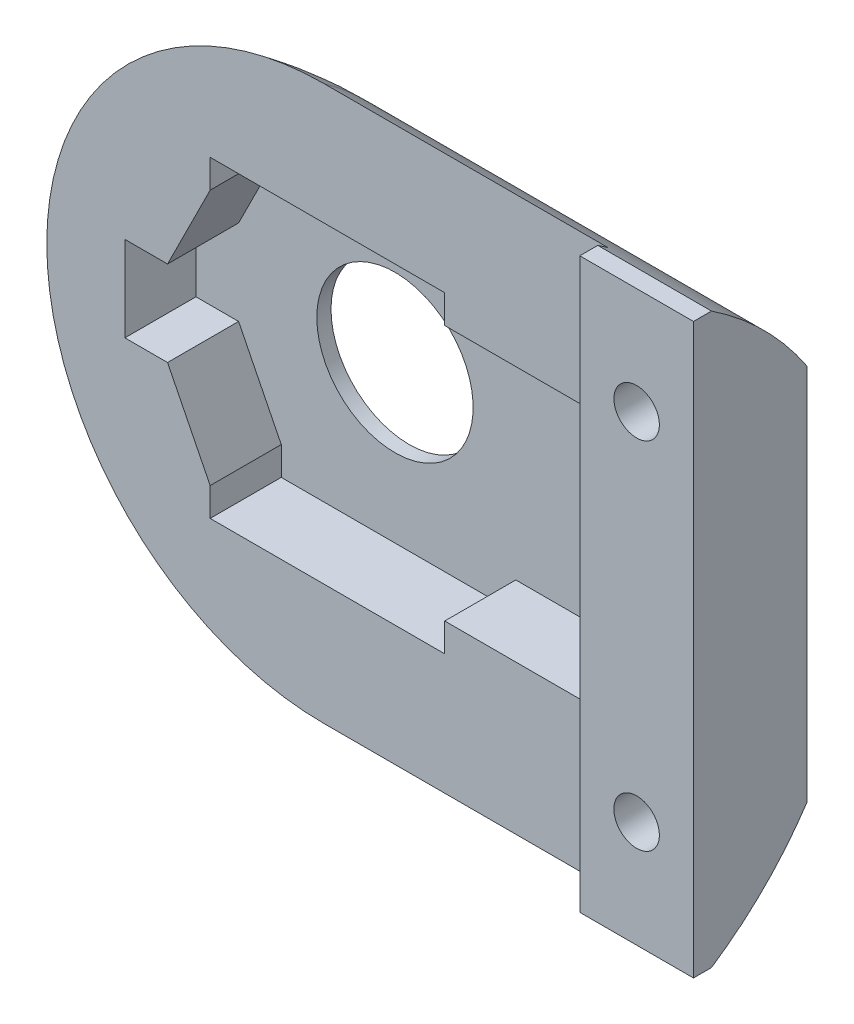
ISO-10303-21;
HEADER;
FILE_DESCRIPTION(('STEP AP214'),'2;1');
FILE_NAME('part.step','',(''),(''),'','','');
FILE_SCHEMA(('AUTOMOTIVE_DESIGN { 1 0 10303 214 1 1 1 1 }'));
ENDSEC;
DATA;
#1=APPLICATION_CONTEXT('core data for automotive mechanical design processes');
#2=APPLICATION_PROTOCOL_DEFINITION('international standard','automotive_design',2000,#1);
#3=PRODUCT_CONTEXT('',#1,'mechanical');
#4=PRODUCT('Part','Part','',(#3));
#5=PRODUCT_RELATED_PRODUCT_CATEGORY('part','',(#4));
#6=PRODUCT_DEFINITION_FORMATION('','',#4);
#7=PRODUCT_DEFINITION_CONTEXT('part definition',#1,'design');
#8=PRODUCT_DEFINITION('design','',#6,#7);
#9=PRODUCT_DEFINITION_SHAPE('','',#8);
#10=(LENGTH_UNIT() NAMED_UNIT(*) SI_UNIT(.MILLI.,.METRE.));
#11=(NAMED_UNIT(*) PLANE_ANGLE_UNIT() SI_UNIT($,.RADIAN.));
#12=(NAMED_UNIT(*) SI_UNIT($,.STERADIAN.) SOLID_ANGLE_UNIT());
#13=UNCERTAINTY_MEASURE_WITH_UNIT(LENGTH_MEASURE(1.E-05),#10,'distance_accuracy_value','');
#14=(GEOMETRIC_REPRESENTATION_CONTEXT(3) GLOBAL_UNCERTAINTY_ASSIGNED_CONTEXT((#13)) GLOBAL_UNIT_ASSIGNED_CONTEXT((#10,
#11,#12)) REPRESENTATION_CONTEXT('',''));
#15=CARTESIAN_POINT('',(0.,0.,0.));
#16=DIRECTION('',(0.,0.,1.));
#17=DIRECTION('',(1.,0.,0.));
#18=AXIS2_PLACEMENT_3D('',#15,#16,#17);
#19=CARTESIAN_POINT('',(0.,0.,0.));
#20=DIRECTION('',(0.,0.,1.));
#21=DIRECTION('',(1.,0.,0.));
#22=AXIS2_PLACEMENT_3D('',#19,#20,#21);
#23=PLANE('',#22);
#24=CARTESIAN_POINT('',(-6.94201640616399E-10,0.,0.));
#25=DIRECTION('',(0.,0.,1.));
#26=DIRECTION('',(1.,0.,0.));
#27=AXIS2_PLACEMENT_3D('',#24,#25,#26);
#28=CIRCLE('',#27,2.75);
#29=CARTESIAN_POINT('',(2.7499999993058,0.,0.));
#30=VERTEX_POINT('',#29);
#31=EDGE_CURVE('E241',#30,#30,#28,.T.);
#32=ORIENTED_EDGE('',*,*,#31,.T.);
#33=EDGE_LOOP('',(#32));
#34=FACE_BOUND('',#33,.T.);
#35=DIRECTION('',(-1.,0.,0.));
#36=VECTOR('',#35,1.);
#37=CARTESIAN_POINT('',(13.9999999993058,-6.6332495807108,0.));
#38=LINE('',#37,#36);
#39=CARTESIAN_POINT('',(0.,-6.6332495807108,0.));
#40=VERTEX_POINT('',#39);
#41=CARTESIAN_POINT('',(10.8102017983973,-6.6332495807108,0.));
#42=VERTEX_POINT('',#41);
#43=EDGE_CURVE('E219',#40,#42,#38,.F.);
#44=ORIENTED_EDGE('',*,*,#43,.F.);
#45=CARTESIAN_POINT('',(0.,0.,0.));
#46=DIRECTION('',(0.,0.,1.));
#47=DIRECTION('',(1.,0.,0.));
#48=AXIS2_PLACEMENT_3D('',#45,#46,#47);
#49=CIRCLE('',#48,6.6332495807108);
#50=CARTESIAN_POINT('',(0.,6.6332495807108,0.));
#51=VERTEX_POINT('',#50);
#52=EDGE_CURVE('E226',#51,#40,#49,.T.);
#53=ORIENTED_EDGE('',*,*,#52,.F.);
#54=DIRECTION('',(-1.,0.,0.));
#55=VECTOR('',#54,1.);
#56=CARTESIAN_POINT('',(13.9999999993058,6.6332495807108,0.));
#57=LINE('',#56,#55);
#58=CARTESIAN_POINT('',(11.297775135829,6.6332495807108,0.));
#59=VERTEX_POINT('',#58);
#60=EDGE_CURVE('E468',#59,#51,#57,.T.);
#61=ORIENTED_EDGE('',*,*,#60,.F.);
#62=CARTESIAN_POINT('',(11.9999999993058,6.25,0.));
#63=DIRECTION('',(0.,0.,1.));
#64=DIRECTION('',(1.,0.,0.));
#65=AXIS2_PLACEMENT_3D('',#62,#63,#64);
#66=CIRCLE('',#65,0.799999999999995);
#67=CARTESIAN_POINT('',(12.7022248627826,6.6332495807108,0.));
#68=VERTEX_POINT('',#67);
#69=EDGE_CURVE('E356',#59,#68,#66,.T.);
#70=ORIENTED_EDGE('',*,*,#69,.T.);
#71=CARTESIAN_POINT('',(13.9999999993058,6.6332495807108,0.));
#72=VERTEX_POINT('',#71);
#73=EDGE_CURVE('E554',#72,#68,#57,.T.);
#74=ORIENTED_EDGE('',*,*,#73,.F.);
#75=DIRECTION('',(0.,-1.,0.));
#76=VECTOR('',#75,1.);
#77=CARTESIAN_POINT('',(13.9999999993058,0.,0.));
#78=LINE('',#77,#76);
#79=CARTESIAN_POINT('',(13.9999999993058,-6.6332495807108,0.));
#80=VERTEX_POINT('',#79);
#81=EDGE_CURVE('E367',#72,#80,#78,.T.);
#82=ORIENTED_EDGE('',*,*,#81,.T.);
#83=CARTESIAN_POINT('',(13.1897982002143,-6.6332495807108,0.));
#84=VERTEX_POINT('',#83);
#85=EDGE_CURVE('E237',#84,#80,#38,.F.);
#86=ORIENTED_EDGE('',*,*,#85,.F.);
#87=CARTESIAN_POINT('',(11.9999999993058,-6.25,0.));
#88=DIRECTION('',(0.,0.,1.));
#89=DIRECTION('',(1.,0.,0.));
#90=AXIS2_PLACEMENT_3D('',#87,#88,#89);
#91=CIRCLE('',#90,1.25);
#92=EDGE_CURVE('E235',#84,#42,#91,.T.);
#93=ORIENTED_EDGE('',*,*,#92,.T.);
#94=EDGE_LOOP('',(#44,#53,#61,#70,#74,#82,#86,#93));
#95=FACE_BOUND('',#94,.T.);
#96=ADVANCED_FACE('F53',(#34,#95),#23,.F.);
#97=CARTESIAN_POINT('',(0.,0.,3.));
#98=DIRECTION('',(0.,0.,1.));
#99=DIRECTION('',(1.,0.,0.));
#100=AXIS2_PLACEMENT_3D('',#97,#98,#99);
#101=PLANE('',#100);
#102=DIRECTION('',(1.,0.,0.));
#103=VECTOR('',#102,1.);
#104=CARTESIAN_POINT('',(-6.9999999985747,-1.5000000000001,3.));
#105=LINE('',#104,#103);
#106=CARTESIAN_POINT('',(-6.9999999985747,-1.5000000000001,3.));
#107=VERTEX_POINT('',#106);
#108=CARTESIAN_POINT('',(-5.49999999857466,-1.50000000000009,3.));
#109=VERTEX_POINT('',#108);
#110=EDGE_CURVE('E250',#107,#109,#105,.T.);
#111=ORIENTED_EDGE('',*,*,#110,.F.);
#112=DIRECTION('',(0.,-1.,0.));
#113=VECTOR('',#112,1.);
#114=CARTESIAN_POINT('',(-6.9999999985747,0.,3.));
#115=LINE('',#114,#113);
#116=CARTESIAN_POINT('',(-6.9999999985747,1.49999999999992,3.));
#117=VERTEX_POINT('',#116);
#118=EDGE_CURVE('E248',#117,#107,#115,.T.);
#119=ORIENTED_EDGE('',*,*,#118,.F.);
#120=DIRECTION('',(-1.,0.,0.));
#121=VECTOR('',#120,1.);
#122=CARTESIAN_POINT('',(-6.9999999985747,1.49999999999992,3.));
#123=LINE('',#122,#121);
#124=CARTESIAN_POINT('',(-5.49999999857472,1.49999999999992,3.));
#125=VERTEX_POINT('',#124);
#126=EDGE_CURVE('E275',#125,#117,#123,.T.);
#127=ORIENTED_EDGE('',*,*,#126,.F.);
#128=DIRECTION('',(-0.447213595499941,-0.894427190999924,0.));
#129=VECTOR('',#128,1.);
#130=CARTESIAN_POINT('',(-5.49999999857472,1.49999999999992,3.));
#131=LINE('',#130,#129);
#132=CARTESIAN_POINT('',(-3.99999999857474,4.50000000000002,3.));
#133=VERTEX_POINT('',#132);
#134=EDGE_CURVE('E273',#133,#125,#131,.T.);
#135=ORIENTED_EDGE('',*,*,#134,.F.);
#136=DIRECTION('',(0.,-1.,0.));
#137=VECTOR('',#136,1.);
#138=CARTESIAN_POINT('',(-3.99999999857474,4.50000000000002,3.));
#139=LINE('',#138,#137);
#140=CARTESIAN_POINT('',(-3.99999999857474,5.5,3.));
#141=VERTEX_POINT('',#140);
#142=EDGE_CURVE('E271',#141,#133,#139,.T.);
#143=ORIENTED_EDGE('',*,*,#142,.F.);
#144=DIRECTION('',(-1.,0.,0.));
#145=VECTOR('',#144,1.);
#146=CARTESIAN_POINT('',(1.42531125790768E-09,5.5,3.));
#147=LINE('',#146,#145);
#148=CARTESIAN_POINT('',(4.25000000142571,5.5,3.));
#149=VERTEX_POINT('',#148);
#150=EDGE_CURVE('E269',#149,#141,#147,.T.);
#151=ORIENTED_EDGE('',*,*,#150,.F.);
#152=DIRECTION('',(0.,1.,0.));
#153=VECTOR('',#152,1.);
#154=CARTESIAN_POINT('',(4.25000000142571,5.5,3.));
#155=LINE('',#154,#153);
#156=CARTESIAN_POINT('',(4.25000000142571,4.49999999999989,3.));
#157=VERTEX_POINT('',#156);
#158=EDGE_CURVE('E267',#157,#149,#155,.T.);
#159=ORIENTED_EDGE('',*,*,#158,.F.);
#160=DIRECTION('',(-1.,0.,0.));
#161=VECTOR('',#160,1.);
#162=CARTESIAN_POINT('',(4.25000000142571,4.49999999999989,3.));
#163=LINE('',#162,#161);
#164=CARTESIAN_POINT('',(9.50000000142534,4.49999999999989,3.));
#165=VERTEX_POINT('',#164);
#166=EDGE_CURVE('E265',#165,#157,#163,.T.);
#167=ORIENTED_EDGE('',*,*,#166,.F.);
#168=DIRECTION('',(0.,1.,0.));
#169=VECTOR('',#168,1.);
#170=CARTESIAN_POINT('',(9.50000000142534,-4.49999999999996,3.));
#171=LINE('',#170,#169);
#172=CARTESIAN_POINT('',(9.50000000142534,-4.49999999999996,3.));
#173=VERTEX_POINT('',#172);
#174=EDGE_CURVE('E263',#173,#165,#171,.T.);
#175=ORIENTED_EDGE('',*,*,#174,.F.);
#176=DIRECTION('',(1.,0.,0.));
#177=VECTOR('',#176,1.);
#178=CARTESIAN_POINT('',(4.2500000014254,-4.49999999999996,3.));
#179=LINE('',#178,#177);
#180=CARTESIAN_POINT('',(4.2500000014254,-4.49999999999996,3.));
#181=VERTEX_POINT('',#180);
#182=EDGE_CURVE('E261',#181,#173,#179,.T.);
#183=ORIENTED_EDGE('',*,*,#182,.F.);
#184=DIRECTION('',(0.,1.,0.));
#185=VECTOR('',#184,1.);
#186=CARTESIAN_POINT('',(4.2500000014254,-5.50000000000002,3.));
#187=LINE('',#186,#185);
#188=CARTESIAN_POINT('',(4.2500000014254,-5.50000000000002,3.));
#189=VERTEX_POINT('',#188);
#190=EDGE_CURVE('E259',#189,#181,#187,.T.);
#191=ORIENTED_EDGE('',*,*,#190,.F.);
#192=DIRECTION('',(1.,0.,0.));
#193=VECTOR('',#192,1.);
#194=CARTESIAN_POINT('',(-3.99999999857464,-5.50000000000002,3.));
#195=LINE('',#194,#193);
#196=CARTESIAN_POINT('',(-3.99999999857464,-5.50000000000002,3.));
#197=VERTEX_POINT('',#196);
#198=EDGE_CURVE('E257',#197,#189,#195,.T.);
#199=ORIENTED_EDGE('',*,*,#198,.F.);
#200=DIRECTION('',(0.,-1.,0.));
#201=VECTOR('',#200,1.);
#202=CARTESIAN_POINT('',(-3.99999999857464,-4.50000000000002,3.));
#203=LINE('',#202,#201);
#204=CARTESIAN_POINT('',(-3.99999999857464,-4.50000000000002,3.));
#205=VERTEX_POINT('',#204);
#206=EDGE_CURVE('E255',#205,#197,#203,.T.);
#207=ORIENTED_EDGE('',*,*,#206,.F.);
#208=DIRECTION('',(0.447213595499971,-0.894427190999909,0.));
#209=VECTOR('',#208,1.);
#210=CARTESIAN_POINT('',(-5.49999999857466,-1.50000000000009,3.));
#211=LINE('',#210,#209);
#212=EDGE_CURVE('E253',#109,#205,#211,.T.);
#213=ORIENTED_EDGE('',*,*,#212,.F.);
#214=EDGE_LOOP('',(#111,#119,#127,#135,#143,#151,#159,#167,#175,#183,#191,#199,#207,#213));
#215=FACE_BOUND('',#214,.T.);
#216=CARTESIAN_POINT('',(0.,0.,3.));
#217=DIRECTION('',(0.,0.,1.));
#218=DIRECTION('',(1.,0.,0.));
#219=AXIS2_PLACEMENT_3D('',#216,#217,#218);
#220=CIRCLE('',#219,9.74679434480896);
#221=CARTESIAN_POINT('',(0.,9.74679434480896,3.));
#222=VERTEX_POINT('',#221);
#223=CARTESIAN_POINT('',(0.,-9.74679434480896,3.));
#224=VERTEX_POINT('',#223);
#225=EDGE_CURVE('E12',#222,#224,#220,.T.);
#226=ORIENTED_EDGE('',*,*,#225,.T.);
#227=DIRECTION('',(-1.,0.,0.));
#228=VECTOR('',#227,1.);
#229=CARTESIAN_POINT('',(13.9999999993058,-9.74679434480896,3.));
#230=LINE('',#229,#228);
#231=CARTESIAN_POINT('',(9.9999999993058,-9.74679434480896,3.));
#232=VERTEX_POINT('',#231);
#233=EDGE_CURVE('E222',#224,#232,#230,.F.);
#234=ORIENTED_EDGE('',*,*,#233,.T.);
#235=DIRECTION('',(0.,-1.,0.));
#236=VECTOR('',#235,1.);
#237=CARTESIAN_POINT('',(9.9999999993058,0.,3.));
#238=LINE('',#237,#236);
#239=CARTESIAN_POINT('',(9.9999999993058,9.74679434480896,3.));
#240=VERTEX_POINT('',#239);
#241=EDGE_CURVE('E360',#240,#232,#238,.T.);
#242=ORIENTED_EDGE('',*,*,#241,.F.);
#243=DIRECTION('',(-1.,0.,0.));
#244=VECTOR('',#243,1.);
#245=CARTESIAN_POINT('',(13.9999999993058,9.74679434480896,3.));
#246=LINE('',#245,#244);
#247=EDGE_CURVE('E455',#240,#222,#246,.T.);
#248=ORIENTED_EDGE('',*,*,#247,.T.);
#249=EDGE_LOOP('',(#226,#234,#242,#248));
#250=FACE_BOUND('',#249,.T.);
#251=ADVANCED_FACE('F410',(#215,#250),#101,.T.);
#252=CARTESIAN_POINT('',(13.9999999993058,0.,4.));
#253=DIRECTION('',(1.,0.,0.));
#254=DIRECTION('',(0.,0.,-1.));
#255=AXIS2_PLACEMENT_3D('',#252,#253,#254);
#256=PLANE('',#255);
#257=DIRECTION('',(0.,0.,-1.));
#258=VECTOR('',#257,1.);
#259=CARTESIAN_POINT('',(13.9999999993058,-10.,4.));
#260=LINE('',#259,#258);
#261=CARTESIAN_POINT('',(13.9999999993058,-10.,4.));
#262=VERTEX_POINT('',#261);
#263=CARTESIAN_POINT('',(13.9999999993058,-10.,3.3667504192892));
#264=VERTEX_POINT('',#263);
#265=EDGE_CURVE('E382',#262,#264,#260,.T.);
#266=ORIENTED_EDGE('',*,*,#265,.T.);
#267=CARTESIAN_POINT('',(13.9999999993058,0.,10.));
#268=DIRECTION('',(1.,0.,0.));
#269=DIRECTION('',(0.,0.,-1.));
#270=AXIS2_PLACEMENT_3D('',#267,#268,#269);
#271=CIRCLE('',#270,12.);
#272=EDGE_CURVE('E552',#80,#264,#271,.F.);
#273=ORIENTED_EDGE('',*,*,#272,.F.);
#274=ORIENTED_EDGE('',*,*,#81,.F.);
#275=CARTESIAN_POINT('',(13.9999999993058,0.,10.));
#276=DIRECTION('',(1.,0.,0.));
#277=DIRECTION('',(0.,0.,-1.));
#278=AXIS2_PLACEMENT_3D('',#275,#276,#277);
#279=CIRCLE('',#278,12.);
#280=CARTESIAN_POINT('',(13.9999999993058,10.,3.3667504192892));
#281=VERTEX_POINT('',#280);
#282=EDGE_CURVE('E444',#281,#72,#279,.F.);
#283=ORIENTED_EDGE('',*,*,#282,.F.);
#284=DIRECTION('',(0.,0.,-1.));
#285=VECTOR('',#284,1.);
#286=CARTESIAN_POINT('',(13.9999999993058,10.,4.));
#287=LINE('',#286,#285);
#288=CARTESIAN_POINT('',(13.9999999993058,10.,4.));
#289=VERTEX_POINT('',#288);
#290=EDGE_CURVE('E377',#289,#281,#287,.T.);
#291=ORIENTED_EDGE('',*,*,#290,.F.);
#292=DIRECTION('',(0.,-1.,0.));
#293=VECTOR('',#292,1.);
#294=CARTESIAN_POINT('',(13.9999999993058,0.,4.));
#295=LINE('',#294,#293);
#296=EDGE_CURVE('E374',#289,#262,#295,.T.);
#297=ORIENTED_EDGE('',*,*,#296,.T.);
#298=EDGE_LOOP('',(#266,#273,#274,#283,#291,#297));
#299=FACE_BOUND('',#298,.T.);
#300=ADVANCED_FACE('F416',(#299),#256,.T.);
#301=CARTESIAN_POINT('',(9.9999999993058,0.,3.));
#302=DIRECTION('',(-1.,0.,0.));
#303=DIRECTION('',(0.,0.,1.));
#304=AXIS2_PLACEMENT_3D('',#301,#302,#303);
#305=PLANE('',#304);
#306=ORIENTED_EDGE('',*,*,#241,.T.);
#307=CARTESIAN_POINT('',(9.9999999993058,0.,10.));
#308=DIRECTION('',(-1.,0.,0.));
#309=DIRECTION('',(0.,0.,1.));
#310=AXIS2_PLACEMENT_3D('',#307,#308,#309);
#311=CIRCLE('',#310,12.);
#312=CARTESIAN_POINT('',(9.9999999993058,-10.,3.3667504192892));
#313=VERTEX_POINT('',#312);
#314=EDGE_CURVE('E451',#232,#313,#311,.T.);
#315=ORIENTED_EDGE('',*,*,#314,.T.);
#316=DIRECTION('',(0.,0.,1.));
#317=VECTOR('',#316,1.);
#318=CARTESIAN_POINT('',(9.9999999993058,-10.,3.));
#319=LINE('',#318,#317);
#320=CARTESIAN_POINT('',(9.9999999993058,-10.,4.));
#321=VERTEX_POINT('',#320);
#322=EDGE_CURVE('E76',#313,#321,#319,.T.);
#323=ORIENTED_EDGE('',*,*,#322,.T.);
#324=DIRECTION('',(0.,-1.,0.));
#325=VECTOR('',#324,1.);
#326=CARTESIAN_POINT('',(9.9999999993058,0.,4.));
#327=LINE('',#326,#325);
#328=CARTESIAN_POINT('',(9.9999999993058,10.,4.));
#329=VERTEX_POINT('',#328);
#330=EDGE_CURVE('E61',#329,#321,#327,.T.);
#331=ORIENTED_EDGE('',*,*,#330,.F.);
#332=DIRECTION('',(0.,0.,1.));
#333=VECTOR('',#332,1.);
#334=CARTESIAN_POINT('',(9.9999999993058,10.,3.));
#335=LINE('',#334,#333);
#336=CARTESIAN_POINT('',(9.9999999993058,10.,3.3667504192892));
#337=VERTEX_POINT('',#336);
#338=EDGE_CURVE('E365',#337,#329,#335,.T.);
#339=ORIENTED_EDGE('',*,*,#338,.F.);
#340=CARTESIAN_POINT('',(9.9999999993058,0.,10.));
#341=DIRECTION('',(-1.,0.,0.));
#342=DIRECTION('',(0.,0.,1.));
#343=AXIS2_PLACEMENT_3D('',#340,#341,#342);
#344=CIRCLE('',#343,12.);
#345=EDGE_CURVE('E452',#337,#240,#344,.T.);
#346=ORIENTED_EDGE('',*,*,#345,.T.);
#347=EDGE_LOOP('',(#306,#315,#323,#331,#339,#346));
#348=FACE_BOUND('',#347,.T.);
#349=ADVANCED_FACE('F422',(#348),#305,.T.);
#350=CARTESIAN_POINT('',(0.,-10.,4.));
#351=DIRECTION('',(0.,-1.,0.));
#352=DIRECTION('',(1.,0.,0.));
#353=AXIS2_PLACEMENT_3D('',#350,#351,#352);
#354=PLANE('',#353);
#355=ORIENTED_EDGE('',*,*,#322,.F.);
#356=DIRECTION('',(-1.,0.,0.));
#357=VECTOR('',#356,1.);
#358=CARTESIAN_POINT('',(13.9999999993058,-10.,3.3667504192892));
#359=LINE('',#358,#357);
#360=EDGE_CURVE('E236',#313,#264,#359,.F.);
#361=ORIENTED_EDGE('',*,*,#360,.T.);
#362=ORIENTED_EDGE('',*,*,#265,.F.);
#363=DIRECTION('',(-1.,0.,0.));
#364=VECTOR('',#363,1.);
#365=CARTESIAN_POINT('',(0.,-10.,4.));
#366=LINE('',#365,#364);
#367=EDGE_CURVE('E371',#262,#321,#366,.T.);
#368=ORIENTED_EDGE('',*,*,#367,.T.);
#369=EDGE_LOOP('',(#355,#361,#362,#368));
#370=FACE_BOUND('',#369,.T.);
#371=ADVANCED_FACE('F424',(#370),#354,.T.);
#372=CARTESIAN_POINT('',(11.9999999993058,-6.25,2.));
#373=DIRECTION('',(0.,0.,-1.));
#374=DIRECTION('',(-1.,0.,0.));
#375=AXIS2_PLACEMENT_3D('',#372,#373,#374);
#376=CYLINDRICAL_SURFACE('',#375,1.25);
#377=CARTESIAN_POINT('',(11.9999999993058,-6.25,2.));
#378=DIRECTION('',(0.,0.,1.));
#379=DIRECTION('',(1.,0.,0.));
#380=AXIS2_PLACEMENT_3D('',#377,#378,#379);
#381=CIRCLE('',#380,1.25);
#382=CARTESIAN_POINT('',(13.2499999993058,-6.25,2.));
#383=VERTEX_POINT('',#382);
#384=EDGE_CURVE('E348',#383,#383,#381,.T.);
#385=ORIENTED_EDGE('',*,*,#384,.T.);
#386=EDGE_LOOP('',(#385));
#387=FACE_BOUND('',#386,.T.);
#388=ORIENTED_EDGE('',*,*,#92,.F.);
#389=CARTESIAN_POINT('',(13.1897982002143,-6.6332495807108,0.));
#390=CARTESIAN_POINT('',(13.1760111998442,-6.6760087882392,0.0283616226910747));
#391=CARTESIAN_POINT('',(13.1599399340859,-6.71803855463574,0.0566384645604791));
#392=CARTESIAN_POINT('',(13.1232041851045,-6.80041761045395,0.112795660502668));
#393=CARTESIAN_POINT('',(13.1025330325254,-6.84076435777378,0.140675375690085));
#394=CARTESIAN_POINT('',(13.0333934076816,-6.95920665563889,0.223564192518988));
#395=CARTESIAN_POINT('',(12.977954607351,-7.0342133932454,0.277495591106915));
#396=CARTESIAN_POINT('',(12.8687502580412,-7.15116328539714,0.363379355782012));
#397=CARTESIAN_POINT('',(12.8195958752711,-7.19622735422989,0.397030437339819));
#398=CARTESIAN_POINT('',(12.7129402508517,-7.27895192105796,0.459584671059698));
#399=CARTESIAN_POINT('',(12.6554681544938,-7.31663723187446,0.488503680084832));
#400=CARTESIAN_POINT('',(12.5435597804518,-7.3770991486764,0.535349183717324));
#401=CARTESIAN_POINT('',(12.4903465058375,-7.40133007544712,0.554313423672287));
#402=CARTESIAN_POINT('',(12.3795195932096,-7.44245595798418,0.586682991778201));
#403=CARTESIAN_POINT('',(12.3219068652787,-7.45935242616792,0.600089465954225));
#404=CARTESIAN_POINT('',(12.2033717950383,-7.48484118535613,0.620371738033939));
#405=CARTESIAN_POINT('',(12.1424324168359,-7.49338545603514,0.62720976731137));
#406=CARTESIAN_POINT('',(12.0195882784033,-7.5013588792503,0.633589547601537));
#407=CARTESIAN_POINT('',(11.9576839777395,-7.50079224607507,0.633134671979761));
#408=CARTESIAN_POINT('',(11.8412178716025,-7.49111366876401,0.625393693748938));
#409=CARTESIAN_POINT('',(11.7865355691522,-7.48285271039056,0.61878789827329));
#410=CARTESIAN_POINT('',(11.6796173191494,-7.45948372494784,0.600195572862186));
#411=CARTESIAN_POINT('',(11.6273818640153,-7.44437432613298,0.588207964951947));
#412=CARTESIAN_POINT('',(11.5245229798735,-7.40737798936943,0.559061368124886));
#413=CARTESIAN_POINT('',(11.4740365953509,-7.38525496064453,0.541722902670707));
#414=CARTESIAN_POINT('',(11.3776245351184,-7.33540211453244,0.503007242275239));
#415=CARTESIAN_POINT('',(11.3316997796923,-7.30767116919061,0.48162923489297));
#416=CARTESIAN_POINT('',(11.2376033895452,-7.2424954750831,0.431917781025675));
#417=CARTESIAN_POINT('',(11.1903203325499,-7.20420254541007,0.40301878285966));
#418=CARTESIAN_POINT('',(11.1027273897473,-7.12235540653427,0.342118524194594));
#419=CARTESIAN_POINT('',(11.062430360595,-7.07879174229111,0.31011170958562));
#420=CARTESIAN_POINT('',(10.9770265480129,-6.97254226767751,0.233261703887828));
#421=CARTESIAN_POINT('',(10.934624233263,-6.90824802280791,0.187631612656495));
#422=CARTESIAN_POINT('',(10.8627571348849,-6.77432180420704,0.0946788307261166));
#423=CARTESIAN_POINT('',(10.8332433832936,-6.70471123523068,0.0473632983759484));
#424=CARTESIAN_POINT('',(10.8102017983973,-6.6332495807108,0.));
#425=B_SPLINE_CURVE_WITH_KNOTS('',3,(#389,#390,#391,#392,#393,#394,#395,#396,#397,#398,#399,
#400,#401,#402,#403,#404,#405,#406,#407,#408,#409,#410,#411,#412,#413,#414,#415,#416,#417,#418,
#419,#420,#421,#422,#423,#424),.UNSPECIFIED.,.F.,.F.,(4,2,2,2,2,2,2,2,2,2,2,2,2,2,2,2,2,4),(0.,
0.159251364799164,0.318735149581607,0.639506493065129,0.86279937960901,1.08532798461955,
1.2689898904694,1.45261390591918,1.63728755073477,1.82187577640286,1.98820157106732,
2.15456069559284,2.32725217451295,2.49997842253782,2.70132478454904,2.90303784668896,
3.17041381481333,3.43676490167392),.UNSPECIFIED.);
#426=EDGE_CURVE('E547',#84,#42,#425,.T.);
#427=ORIENTED_EDGE('',*,*,#426,.T.);
#428=EDGE_LOOP('',(#388,#427));
#429=FACE_BOUND('',#428,.T.);
#430=ADVANCED_FACE('F426',(#387,#429),#376,.F.);
#431=CARTESIAN_POINT('',(0.,10.,4.));
#432=DIRECTION('',(0.,1.,0.));
#433=DIRECTION('',(0.,0.,1.));
#434=AXIS2_PLACEMENT_3D('',#431,#432,#433);
#435=PLANE('',#434);
#436=ORIENTED_EDGE('',*,*,#290,.T.);
#437=DIRECTION('',(-1.,0.,0.));
#438=VECTOR('',#437,1.);
#439=CARTESIAN_POINT('',(13.9999999993058,10.,3.3667504192892));
#440=LINE('',#439,#438);
#441=EDGE_CURVE('E447',#281,#337,#440,.T.);
#442=ORIENTED_EDGE('',*,*,#441,.T.);
#443=ORIENTED_EDGE('',*,*,#338,.T.);
#444=DIRECTION('',(1.,0.,0.));
#445=VECTOR('',#444,1.);
#446=CARTESIAN_POINT('',(0.,10.,4.));
#447=LINE('',#446,#445);
#448=EDGE_CURVE('E369',#329,#289,#447,.T.);
#449=ORIENTED_EDGE('',*,*,#448,.T.);
#450=EDGE_LOOP('',(#436,#442,#443,#449));
#451=FACE_BOUND('',#450,.T.);
#452=ADVANCED_FACE('F55',(#451),#435,.T.);
#453=CARTESIAN_POINT('',(11.9999999993058,6.25,4.));
#454=DIRECTION('',(0.,0.,-1.));
#455=DIRECTION('',(-1.,0.,0.));
#456=AXIS2_PLACEMENT_3D('',#453,#454,#455);
#457=CYLINDRICAL_SURFACE('',#456,0.799999999999995);
#458=CARTESIAN_POINT('',(11.9999999993058,6.25,4.));
#459=DIRECTION('',(0.,0.,1.));
#460=DIRECTION('',(1.,0.,0.));
#461=AXIS2_PLACEMENT_3D('',#458,#459,#460);
#462=CIRCLE('',#461,0.799999999999995);
#463=CARTESIAN_POINT('',(12.7999999993058,6.25,4.));
#464=VERTEX_POINT('',#463);
#465=EDGE_CURVE('E357',#464,#464,#462,.T.);
#466=ORIENTED_EDGE('',*,*,#465,.T.);
#467=EDGE_LOOP('',(#466));
#468=FACE_BOUND('',#467,.T.);
#469=ORIENTED_EDGE('',*,*,#69,.F.);
#470=CARTESIAN_POINT('',(11.297775135829,6.6332495807108,0.));
#471=CARTESIAN_POINT('',(11.3196969704383,6.67343057533731,0.0266404093304864));
#472=CARTESIAN_POINT('',(11.3453260660016,6.71216672349842,0.0526965732116889));
#473=CARTESIAN_POINT('',(11.4039375292939,6.78566017921512,0.102690349356819));
#474=CARTESIAN_POINT('',(11.4369640425219,6.82039162001087,0.126613984358144));
#475=CARTESIAN_POINT('',(11.5040174398071,6.87900161122777,0.167380343010836));
#476=CARTESIAN_POINT('',(11.5369837877532,6.90372550970297,0.184740345159731));
#477=CARTESIAN_POINT('',(11.607394233928,6.94827709698219,0.216228459272557));
#478=CARTESIAN_POINT('',(11.6448287743717,6.96811496826996,0.230363287894444));
#479=CARTESIAN_POINT('',(11.7238642719518,7.00207265238321,0.254671737605355));
#480=CARTESIAN_POINT('',(11.7654988404407,7.01614087658447,0.264809590412559));
#481=CARTESIAN_POINT('',(11.8513894267292,7.03731508039173,0.280104294329561));
#482=CARTESIAN_POINT('',(11.8956435636978,7.04442599251023,0.285264674272178));
#483=CARTESIAN_POINT('',(11.9787105719222,7.05064505812971,0.289777842124932));
#484=CARTESIAN_POINT('',(12.0174142374225,7.05073732748972,0.289844801700724));
#485=CARTESIAN_POINT('',(12.0942203147778,7.04536346100232,0.285944980805873));
#486=CARTESIAN_POINT('',(12.1323228504838,7.0398984857131,0.281979042553433));
#487=CARTESIAN_POINT('',(12.2049792930375,7.02414449567698,0.270586794572164));
#488=CARTESIAN_POINT('',(12.2396156938998,7.01410184836698,0.263337316083468));
#489=CARTESIAN_POINT('',(12.3065554600505,6.98979212031996,0.245871173139462));
#490=CARTESIAN_POINT('',(12.3388589774893,6.97552531539183,0.235654702409482));
#491=CARTESIAN_POINT('',(12.4034054127946,6.94188552163604,0.211706642730378));
#492=CARTESIAN_POINT('',(12.4353809028887,6.9221684012373,0.197741356652355));
#493=CARTESIAN_POINT('',(12.4955999223401,6.87909049269908,0.167461650457403));
#494=CARTESIAN_POINT('',(12.5238367523398,6.85572332297777,0.15114311994622));
#495=CARTESIAN_POINT('',(12.5811818235285,6.80141925602571,0.113546291997455));
#496=CARTESIAN_POINT('',(12.609482812861,6.7698819327225,0.0919091716150689));
#497=CARTESIAN_POINT('',(12.6602236190519,6.70369169379657,0.0470029070884053));
#498=CARTESIAN_POINT('',(12.6826876764347,6.6690524938415,0.0237410387546282));
#499=CARTESIAN_POINT('',(12.7022248627826,6.6332495807108,0.));
#500=B_SPLINE_CURVE_WITH_KNOTS('',3,(#470,#471,#472,#473,#474,#475,#476,#477,#478,#479,#480,
#481,#482,#483,#484,#485,#486,#487,#488,#489,#490,#491,#492,#493,#494,#495,#496,#497,#498,#499),
.UNSPECIFIED.,.F.,.F.,(4,2,2,2,2,2,2,2,2,2,2,2,2,2,4),(0.,0.158964557858904,0.318904313775007,
0.452503407430769,0.585821678824546,0.72030729343434,0.854697492791078,0.970203643141492,
1.08568567648924,1.19557661272693,1.30546037541251,1.42523957238803,1.54523057952048,
1.68744568634952,1.82906038306878),.UNSPECIFIED.);
#501=EDGE_CURVE('E457',#59,#68,#500,.T.);
#502=ORIENTED_EDGE('',*,*,#501,.T.);
#503=EDGE_LOOP('',(#469,#502));
#504=FACE_BOUND('',#503,.T.);
#505=ADVANCED_FACE('F395',(#468,#504),#457,.F.);
#506=CARTESIAN_POINT('',(0.,0.,0.5));
#507=DIRECTION('',(0.,0.,-1.));
#508=DIRECTION('',(-1.,0.,0.));
#509=AXIS2_PLACEMENT_3D('',#506,#507,#508);
#510=PLANE('',#509);
#511=DIRECTION('',(0.,-1.,0.));
#512=VECTOR('',#511,1.);
#513=CARTESIAN_POINT('',(-6.9999999985747,0.,0.5));
#514=LINE('',#513,#512);
#515=CARTESIAN_POINT('',(-6.9999999985747,1.49999999999992,0.5));
#516=VERTEX_POINT('',#515);
#517=CARTESIAN_POINT('',(-6.9999999985747,-1.5000000000001,0.5));
#518=VERTEX_POINT('',#517);
#519=EDGE_CURVE('E278',#516,#518,#514,.T.);
#520=ORIENTED_EDGE('',*,*,#519,.T.);
#521=DIRECTION('',(1.,0.,0.));
#522=VECTOR('',#521,1.);
#523=CARTESIAN_POINT('',(-6.9999999985747,-1.5000000000001,0.5));
#524=LINE('',#523,#522);
#525=CARTESIAN_POINT('',(-5.49999999857466,-1.50000000000009,0.5));
#526=VERTEX_POINT('',#525);
#527=EDGE_CURVE('E280',#518,#526,#524,.T.);
#528=ORIENTED_EDGE('',*,*,#527,.T.);
#529=DIRECTION('',(0.447213595499971,-0.894427190999909,0.));
#530=VECTOR('',#529,1.);
#531=CARTESIAN_POINT('',(-5.49999999857466,-1.50000000000009,0.5));
#532=LINE('',#531,#530);
#533=CARTESIAN_POINT('',(-3.99999999857464,-4.50000000000002,0.5));
#534=VERTEX_POINT('',#533);
#535=EDGE_CURVE('E282',#526,#534,#532,.T.);
#536=ORIENTED_EDGE('',*,*,#535,.T.);
#537=DIRECTION('',(0.,-1.,0.));
#538=VECTOR('',#537,1.);
#539=CARTESIAN_POINT('',(-3.99999999857464,-4.50000000000002,0.5));
#540=LINE('',#539,#538);
#541=CARTESIAN_POINT('',(-3.99999999857464,-5.50000000000002,0.5));
#542=VERTEX_POINT('',#541);
#543=EDGE_CURVE('E284',#534,#542,#540,.T.);
#544=ORIENTED_EDGE('',*,*,#543,.T.);
#545=DIRECTION('',(1.,0.,0.));
#546=VECTOR('',#545,1.);
#547=CARTESIAN_POINT('',(1.42531125790768E-09,-5.50000000000002,0.5));
#548=LINE('',#547,#546);
#549=CARTESIAN_POINT('',(4.2500000014254,-5.50000000000002,0.5));
#550=VERTEX_POINT('',#549);
#551=EDGE_CURVE('E287',#542,#550,#548,.T.);
#552=ORIENTED_EDGE('',*,*,#551,.T.);
#553=DIRECTION('',(0.,1.,0.));
#554=VECTOR('',#553,1.);
#555=CARTESIAN_POINT('',(4.2500000014254,-5.50000000000002,0.5));
#556=LINE('',#555,#554);
#557=CARTESIAN_POINT('',(4.2500000014254,-4.49999999999996,0.5));
#558=VERTEX_POINT('',#557);
#559=EDGE_CURVE('E289',#550,#558,#556,.T.);
#560=ORIENTED_EDGE('',*,*,#559,.T.);
#561=DIRECTION('',(1.,0.,0.));
#562=VECTOR('',#561,1.);
#563=CARTESIAN_POINT('',(4.2500000014254,-4.49999999999996,0.5));
#564=LINE('',#563,#562);
#565=CARTESIAN_POINT('',(9.50000000142534,-4.49999999999996,0.5));
#566=VERTEX_POINT('',#565);
#567=EDGE_CURVE('E291',#558,#566,#564,.T.);
#568=ORIENTED_EDGE('',*,*,#567,.T.);
#569=DIRECTION('',(0.,1.,0.));
#570=VECTOR('',#569,1.);
#571=CARTESIAN_POINT('',(9.50000000142534,4.49999999999989,0.5));
#572=LINE('',#571,#570);
#573=CARTESIAN_POINT('',(9.50000000142534,4.49999999999989,0.5));
#574=VERTEX_POINT('',#573);
#575=EDGE_CURVE('E294',#566,#574,#572,.T.);
#576=ORIENTED_EDGE('',*,*,#575,.T.);
#577=DIRECTION('',(-1.,0.,0.));
#578=VECTOR('',#577,1.);
#579=CARTESIAN_POINT('',(4.25000000142571,4.49999999999989,0.5));
#580=LINE('',#579,#578);
#581=CARTESIAN_POINT('',(4.25000000142571,4.49999999999989,0.5));
#582=VERTEX_POINT('',#581);
#583=EDGE_CURVE('E296',#574,#582,#580,.T.);
#584=ORIENTED_EDGE('',*,*,#583,.T.);
#585=DIRECTION('',(0.,1.,0.));
#586=VECTOR('',#585,1.);
#587=CARTESIAN_POINT('',(4.25000000142571,5.5,0.5));
#588=LINE('',#587,#586);
#589=CARTESIAN_POINT('',(4.25000000142571,5.5,0.5));
#590=VERTEX_POINT('',#589);
#591=EDGE_CURVE('E298',#582,#590,#588,.T.);
#592=ORIENTED_EDGE('',*,*,#591,.T.);
#593=DIRECTION('',(-1.,0.,0.));
#594=VECTOR('',#593,1.);
#595=CARTESIAN_POINT('',(-3.99999999857474,5.5,0.5));
#596=LINE('',#595,#594);
#597=CARTESIAN_POINT('',(-3.99999999857474,5.5,0.5));
#598=VERTEX_POINT('',#597);
#599=EDGE_CURVE('E301',#590,#598,#596,.T.);
#600=ORIENTED_EDGE('',*,*,#599,.T.);
#601=DIRECTION('',(0.,-1.,0.));
#602=VECTOR('',#601,1.);
#603=CARTESIAN_POINT('',(-3.99999999857474,4.50000000000002,0.5));
#604=LINE('',#603,#602);
#605=CARTESIAN_POINT('',(-3.99999999857474,4.50000000000002,0.5));
#606=VERTEX_POINT('',#605);
#607=EDGE_CURVE('E303',#598,#606,#604,.T.);
#608=ORIENTED_EDGE('',*,*,#607,.T.);
#609=DIRECTION('',(-0.447213595499941,-0.894427190999924,0.));
#610=VECTOR('',#609,1.);
#611=CARTESIAN_POINT('',(-5.49999999857472,1.49999999999992,0.5));
#612=LINE('',#611,#610);
#613=CARTESIAN_POINT('',(-5.49999999857472,1.49999999999992,0.5));
#614=VERTEX_POINT('',#613);
#615=EDGE_CURVE('E305',#606,#614,#612,.T.);
#616=ORIENTED_EDGE('',*,*,#615,.T.);
#617=DIRECTION('',(-1.,0.,0.));
#618=VECTOR('',#617,1.);
#619=CARTESIAN_POINT('',(-6.9999999985747,1.49999999999992,0.5));
#620=LINE('',#619,#618);
#621=EDGE_CURVE('E251',#614,#516,#620,.T.);
#622=ORIENTED_EDGE('',*,*,#621,.T.);
#623=EDGE_LOOP('',(#520,#528,#536,#544,#552,#560,#568,#576,#584,#592,#600,#608,#616,#622));
#624=FACE_BOUND('',#623,.T.);
#625=CARTESIAN_POINT('',(-6.94201640616399E-10,0.,0.5));
#626=DIRECTION('',(0.,0.,-1.));
#627=DIRECTION('',(-1.,0.,0.));
#628=AXIS2_PLACEMENT_3D('',#625,#626,#627);
#629=CIRCLE('',#628,2.75);
#630=CARTESIAN_POINT('',(-2.7500000006942,0.,0.5));
#631=VERTEX_POINT('',#630);
#632=EDGE_CURVE('E244',#631,#631,#629,.F.);
#633=ORIENTED_EDGE('',*,*,#632,.F.);
#634=EDGE_LOOP('',(#633));
#635=FACE_BOUND('',#634,.T.);
#636=ADVANCED_FACE('F392',(#624,#635),#510,.F.);
#637=CARTESIAN_POINT('',(0.,0.,4.));
#638=DIRECTION('',(0.,0.,1.));
#639=DIRECTION('',(1.,0.,0.));
#640=AXIS2_PLACEMENT_3D('',#637,#638,#639);
#641=PLANE('',#640);
#642=ORIENTED_EDGE('',*,*,#465,.F.);
#643=EDGE_LOOP('',(#642));
#644=FACE_BOUND('',#643,.T.);
#645=ORIENTED_EDGE('',*,*,#448,.F.);
#646=ORIENTED_EDGE('',*,*,#330,.T.);
#647=ORIENTED_EDGE('',*,*,#367,.F.);
#648=ORIENTED_EDGE('',*,*,#296,.F.);
#649=EDGE_LOOP('',(#645,#646,#647,#648));
#650=FACE_BOUND('',#649,.T.);
#651=CARTESIAN_POINT('',(11.9999999993058,-6.25,4.));
#652=DIRECTION('',(0.,0.,1.));
#653=DIRECTION('',(1.,0.,0.));
#654=AXIS2_PLACEMENT_3D('',#651,#652,#653);
#655=CIRCLE('',#654,0.800000000000002);
#656=CARTESIAN_POINT('',(12.7999999993058,-6.25,4.));
#657=VERTEX_POINT('',#656);
#658=EDGE_CURVE('E353',#657,#657,#655,.T.);
#659=ORIENTED_EDGE('',*,*,#658,.F.);
#660=EDGE_LOOP('',(#659));
#661=FACE_BOUND('',#660,.T.);
#662=ADVANCED_FACE('F394',(#644,#650,#661),#641,.T.);
#663=CARTESIAN_POINT('',(11.9999999993058,-6.25,4.));
#664=DIRECTION('',(0.,0.,-1.));
#665=DIRECTION('',(-1.,0.,0.));
#666=AXIS2_PLACEMENT_3D('',#663,#664,#665);
#667=CYLINDRICAL_SURFACE('',#666,0.800000000000002);
#668=CARTESIAN_POINT('',(11.9999999993058,-6.25,2.));
#669=DIRECTION('',(0.,0.,1.));
#670=DIRECTION('',(1.,0.,0.));
#671=AXIS2_PLACEMENT_3D('',#668,#669,#670);
#672=CIRCLE('',#671,0.800000000000002);
#673=CARTESIAN_POINT('',(12.7999999993058,-6.25,2.));
#674=VERTEX_POINT('',#673);
#675=EDGE_CURVE('E351',#674,#674,#672,.T.);
#676=ORIENTED_EDGE('',*,*,#675,.F.);
#677=EDGE_LOOP('',(#676));
#678=FACE_BOUND('',#677,.T.);
#679=ORIENTED_EDGE('',*,*,#658,.T.);
#680=EDGE_LOOP('',(#679));
#681=FACE_BOUND('',#680,.T.);
#682=ADVANCED_FACE('F402',(#678,#681),#667,.F.);
#683=CARTESIAN_POINT('',(11.9999999993058,-6.25,2.));
#684=DIRECTION('',(0.,0.,1.));
#685=DIRECTION('',(1.,0.,0.));
#686=AXIS2_PLACEMENT_3D('',#683,#684,#685);
#687=PLANE('',#686);
#688=ORIENTED_EDGE('',*,*,#675,.T.);
#689=EDGE_LOOP('',(#688));
#690=FACE_BOUND('',#689,.T.);
#691=ORIENTED_EDGE('',*,*,#384,.F.);
#692=EDGE_LOOP('',(#691));
#693=FACE_BOUND('',#692,.T.);
#694=ADVANCED_FACE('F541',(#690,#693),#687,.F.);
#695=CARTESIAN_POINT('',(-6.9999999985747,0.,3.));
#696=DIRECTION('',(1.,0.,0.));
#697=DIRECTION('',(0.,0.,-1.));
#698=AXIS2_PLACEMENT_3D('',#695,#696,#697);
#699=PLANE('',#698);
#700=ORIENTED_EDGE('',*,*,#519,.F.);
#701=DIRECTION('',(0.,0.,-1.));
#702=VECTOR('',#701,1.);
#703=CARTESIAN_POINT('',(-6.9999999985747,1.49999999999992,3.));
#704=LINE('',#703,#702);
#705=EDGE_CURVE('E277',#117,#516,#704,.T.);
#706=ORIENTED_EDGE('',*,*,#705,.F.);
#707=ORIENTED_EDGE('',*,*,#118,.T.);
#708=DIRECTION('',(0.,0.,-1.));
#709=VECTOR('',#708,1.);
#710=CARTESIAN_POINT('',(-6.9999999985747,-1.5000000000001,3.));
#711=LINE('',#710,#709);
#712=EDGE_CURVE('E345',#107,#518,#711,.T.);
#713=ORIENTED_EDGE('',*,*,#712,.T.);
#714=EDGE_LOOP('',(#700,#706,#707,#713));
#715=FACE_BOUND('',#714,.T.);
#716=ADVANCED_FACE('F537',(#715),#699,.T.);
#717=CARTESIAN_POINT('',(-6.9999999985747,-1.5000000000001,3.));
#718=DIRECTION('',(0.,1.,0.));
#719=DIRECTION('',(-1.,0.,0.));
#720=AXIS2_PLACEMENT_3D('',#717,#718,#719);
#721=PLANE('',#720);
#722=ORIENTED_EDGE('',*,*,#527,.F.);
#723=ORIENTED_EDGE('',*,*,#712,.F.);
#724=ORIENTED_EDGE('',*,*,#110,.T.);
#725=DIRECTION('',(0.,0.,-1.));
#726=VECTOR('',#725,1.);
#727=CARTESIAN_POINT('',(-5.49999999857466,-1.50000000000009,3.));
#728=LINE('',#727,#726);
#729=EDGE_CURVE('E342',#109,#526,#728,.T.);
#730=ORIENTED_EDGE('',*,*,#729,.T.);
#731=EDGE_LOOP('',(#722,#723,#724,#730));
#732=FACE_BOUND('',#731,.T.);
#733=ADVANCED_FACE('F533',(#732),#721,.T.);
#734=CARTESIAN_POINT('',(-5.49999999857466,-1.50000000000009,3.));
#735=DIRECTION('',(0.894427190999909,0.447213595499972,0.));
#736=DIRECTION('',(-0.447213595499972,0.894427190999909,0.));
#737=AXIS2_PLACEMENT_3D('',#734,#735,#736);
#738=PLANE('',#737);
#739=ORIENTED_EDGE('',*,*,#535,.F.);
#740=ORIENTED_EDGE('',*,*,#729,.F.);
#741=ORIENTED_EDGE('',*,*,#212,.T.);
#742=DIRECTION('',(0.,0.,-1.));
#743=VECTOR('',#742,1.);
#744=CARTESIAN_POINT('',(-3.99999999857464,-4.50000000000002,3.));
#745=LINE('',#744,#743);
#746=EDGE_CURVE('E339',#205,#534,#745,.T.);
#747=ORIENTED_EDGE('',*,*,#746,.T.);
#748=EDGE_LOOP('',(#739,#740,#741,#747));
#749=FACE_BOUND('',#748,.T.);
#750=ADVANCED_FACE('F529',(#749),#738,.T.);
#751=CARTESIAN_POINT('',(-3.99999999857464,-4.50000000000002,3.));
#752=DIRECTION('',(1.,0.,0.));
#753=DIRECTION('',(0.,0.,-1.));
#754=AXIS2_PLACEMENT_3D('',#751,#752,#753);
#755=PLANE('',#754);
#756=ORIENTED_EDGE('',*,*,#543,.F.);
#757=ORIENTED_EDGE('',*,*,#746,.F.);
#758=ORIENTED_EDGE('',*,*,#206,.T.);
#759=DIRECTION('',(0.,0.,-1.));
#760=VECTOR('',#759,1.);
#761=CARTESIAN_POINT('',(-3.99999999857464,-5.50000000000002,3.));
#762=LINE('',#761,#760);
#763=EDGE_CURVE('E336',#197,#542,#762,.T.);
#764=ORIENTED_EDGE('',*,*,#763,.T.);
#765=EDGE_LOOP('',(#756,#757,#758,#764));
#766=FACE_BOUND('',#765,.T.);
#767=ADVANCED_FACE('F525',(#766),#755,.T.);
#768=CARTESIAN_POINT('',(1.42531125790768E-09,-5.50000000000002,3.));
#769=DIRECTION('',(0.,1.,0.));
#770=DIRECTION('',(0.,0.,1.));
#771=AXIS2_PLACEMENT_3D('',#768,#769,#770);
#772=PLANE('',#771);
#773=ORIENTED_EDGE('',*,*,#551,.F.);
#774=ORIENTED_EDGE('',*,*,#763,.F.);
#775=ORIENTED_EDGE('',*,*,#198,.T.);
#776=DIRECTION('',(0.,0.,-1.));
#777=VECTOR('',#776,1.);
#778=CARTESIAN_POINT('',(4.2500000014254,-5.50000000000002,3.));
#779=LINE('',#778,#777);
#780=EDGE_CURVE('E333',#189,#550,#779,.T.);
#781=ORIENTED_EDGE('',*,*,#780,.T.);
#782=EDGE_LOOP('',(#773,#774,#775,#781));
#783=FACE_BOUND('',#782,.T.);
#784=ADVANCED_FACE('F521',(#783),#772,.T.);
#785=CARTESIAN_POINT('',(4.2500000014254,-5.50000000000002,3.));
#786=DIRECTION('',(-1.,0.,0.));
#787=DIRECTION('',(0.,0.,1.));
#788=AXIS2_PLACEMENT_3D('',#785,#786,#787);
#789=PLANE('',#788);
#790=ORIENTED_EDGE('',*,*,#559,.F.);
#791=ORIENTED_EDGE('',*,*,#780,.F.);
#792=ORIENTED_EDGE('',*,*,#190,.T.);
#793=DIRECTION('',(0.,0.,-1.));
#794=VECTOR('',#793,1.);
#795=CARTESIAN_POINT('',(4.2500000014254,-4.49999999999996,3.));
#796=LINE('',#795,#794);
#797=EDGE_CURVE('E330',#181,#558,#796,.T.);
#798=ORIENTED_EDGE('',*,*,#797,.T.);
#799=EDGE_LOOP('',(#790,#791,#792,#798));
#800=FACE_BOUND('',#799,.T.);
#801=ADVANCED_FACE('F517',(#800),#789,.T.);
#802=CARTESIAN_POINT('',(4.2500000014254,-4.49999999999996,3.));
#803=DIRECTION('',(0.,1.,0.));
#804=DIRECTION('',(0.,0.,1.));
#805=AXIS2_PLACEMENT_3D('',#802,#803,#804);
#806=PLANE('',#805);
#807=ORIENTED_EDGE('',*,*,#567,.F.);
#808=ORIENTED_EDGE('',*,*,#797,.F.);
#809=ORIENTED_EDGE('',*,*,#182,.T.);
#810=DIRECTION('',(0.,0.,-1.));
#811=VECTOR('',#810,1.);
#812=CARTESIAN_POINT('',(9.50000000142534,-4.49999999999996,3.));
#813=LINE('',#812,#811);
#814=EDGE_CURVE('E327',#173,#566,#813,.T.);
#815=ORIENTED_EDGE('',*,*,#814,.T.);
#816=EDGE_LOOP('',(#807,#808,#809,#815));
#817=FACE_BOUND('',#816,.T.);
#818=ADVANCED_FACE('F513',(#817),#806,.T.);
#819=CARTESIAN_POINT('',(9.50000000142534,4.49999999999989,3.));
#820=DIRECTION('',(-1.,0.,0.));
#821=DIRECTION('',(0.,0.,1.));
#822=AXIS2_PLACEMENT_3D('',#819,#820,#821);
#823=PLANE('',#822);
#824=ORIENTED_EDGE('',*,*,#575,.F.);
#825=ORIENTED_EDGE('',*,*,#814,.F.);
#826=ORIENTED_EDGE('',*,*,#174,.T.);
#827=DIRECTION('',(0.,0.,-1.));
#828=VECTOR('',#827,1.);
#829=CARTESIAN_POINT('',(9.50000000142534,4.49999999999989,3.));
#830=LINE('',#829,#828);
#831=EDGE_CURVE('E324',#165,#574,#830,.T.);
#832=ORIENTED_EDGE('',*,*,#831,.T.);
#833=EDGE_LOOP('',(#824,#825,#826,#832));
#834=FACE_BOUND('',#833,.T.);
#835=ADVANCED_FACE('F509',(#834),#823,.T.);
#836=CARTESIAN_POINT('',(4.25000000142571,4.49999999999989,3.));
#837=DIRECTION('',(0.,-1.,0.));
#838=DIRECTION('',(0.,0.,-1.));
#839=AXIS2_PLACEMENT_3D('',#836,#837,#838);
#840=PLANE('',#839);
#841=ORIENTED_EDGE('',*,*,#583,.F.);
#842=ORIENTED_EDGE('',*,*,#831,.F.);
#843=ORIENTED_EDGE('',*,*,#166,.T.);
#844=DIRECTION('',(0.,0.,-1.));
#845=VECTOR('',#844,1.);
#846=CARTESIAN_POINT('',(4.25000000142571,4.49999999999989,3.));
#847=LINE('',#846,#845);
#848=EDGE_CURVE('E321',#157,#582,#847,.T.);
#849=ORIENTED_EDGE('',*,*,#848,.T.);
#850=EDGE_LOOP('',(#841,#842,#843,#849));
#851=FACE_BOUND('',#850,.T.);
#852=ADVANCED_FACE('F505',(#851),#840,.T.);
#853=CARTESIAN_POINT('',(4.25000000142571,5.5,3.));
#854=DIRECTION('',(-1.,0.,0.));
#855=DIRECTION('',(0.,0.,1.));
#856=AXIS2_PLACEMENT_3D('',#853,#854,#855);
#857=PLANE('',#856);
#858=ORIENTED_EDGE('',*,*,#591,.F.);
#859=ORIENTED_EDGE('',*,*,#848,.F.);
#860=ORIENTED_EDGE('',*,*,#158,.T.);
#861=DIRECTION('',(0.,0.,-1.));
#862=VECTOR('',#861,1.);
#863=CARTESIAN_POINT('',(4.25000000142571,5.5,3.));
#864=LINE('',#863,#862);
#865=EDGE_CURVE('E318',#149,#590,#864,.T.);
#866=ORIENTED_EDGE('',*,*,#865,.T.);
#867=EDGE_LOOP('',(#858,#859,#860,#866));
#868=FACE_BOUND('',#867,.T.);
#869=ADVANCED_FACE('F501',(#868),#857,.T.);
#870=CARTESIAN_POINT('',(-3.99999999857474,5.5,3.));
#871=DIRECTION('',(0.,-1.,0.));
#872=DIRECTION('',(0.,0.,-1.));
#873=AXIS2_PLACEMENT_3D('',#870,#871,#872);
#874=PLANE('',#873);
#875=ORIENTED_EDGE('',*,*,#599,.F.);
#876=ORIENTED_EDGE('',*,*,#865,.F.);
#877=ORIENTED_EDGE('',*,*,#150,.T.);
#878=DIRECTION('',(0.,0.,-1.));
#879=VECTOR('',#878,1.);
#880=CARTESIAN_POINT('',(-3.99999999857474,5.5,3.));
#881=LINE('',#880,#879);
#882=EDGE_CURVE('E315',#141,#598,#881,.T.);
#883=ORIENTED_EDGE('',*,*,#882,.T.);
#884=EDGE_LOOP('',(#875,#876,#877,#883));
#885=FACE_BOUND('',#884,.T.);
#886=ADVANCED_FACE('F497',(#885),#874,.T.);
#887=CARTESIAN_POINT('',(-3.99999999857474,4.50000000000002,3.));
#888=DIRECTION('',(1.,0.,0.));
#889=DIRECTION('',(0.,0.,-1.));
#890=AXIS2_PLACEMENT_3D('',#887,#888,#889);
#891=PLANE('',#890);
#892=ORIENTED_EDGE('',*,*,#607,.F.);
#893=ORIENTED_EDGE('',*,*,#882,.F.);
#894=ORIENTED_EDGE('',*,*,#142,.T.);
#895=DIRECTION('',(0.,0.,-1.));
#896=VECTOR('',#895,1.);
#897=CARTESIAN_POINT('',(-3.99999999857474,4.50000000000002,3.));
#898=LINE('',#897,#896);
#899=EDGE_CURVE('E312',#133,#606,#898,.T.);
#900=ORIENTED_EDGE('',*,*,#899,.T.);
#901=EDGE_LOOP('',(#892,#893,#894,#900));
#902=FACE_BOUND('',#901,.T.);
#903=ADVANCED_FACE('F491',(#902),#891,.T.);
#904=CARTESIAN_POINT('',(-5.49999999857472,1.49999999999992,3.));
#905=DIRECTION('',(0.894427190999924,-0.447213595499941,0.));
#906=DIRECTION('',(0.447213595499941,0.894427190999924,0.));
#907=AXIS2_PLACEMENT_3D('',#904,#905,#906);
#908=PLANE('',#907);
#909=ORIENTED_EDGE('',*,*,#615,.F.);
#910=ORIENTED_EDGE('',*,*,#899,.F.);
#911=ORIENTED_EDGE('',*,*,#134,.T.);
#912=DIRECTION('',(0.,0.,-1.));
#913=VECTOR('',#912,1.);
#914=CARTESIAN_POINT('',(-5.49999999857472,1.49999999999992,3.));
#915=LINE('',#914,#913);
#916=EDGE_CURVE('E68',#125,#614,#915,.T.);
#917=ORIENTED_EDGE('',*,*,#916,.T.);
#918=EDGE_LOOP('',(#909,#910,#911,#917));
#919=FACE_BOUND('',#918,.T.);
#920=ADVANCED_FACE('F486',(#919),#908,.T.);
#921=CARTESIAN_POINT('',(-6.9999999985747,1.49999999999992,3.));
#922=DIRECTION('',(0.,-1.,0.));
#923=DIRECTION('',(0.,0.,-1.));
#924=AXIS2_PLACEMENT_3D('',#921,#922,#923);
#925=PLANE('',#924);
#926=ORIENTED_EDGE('',*,*,#621,.F.);
#927=ORIENTED_EDGE('',*,*,#916,.F.);
#928=ORIENTED_EDGE('',*,*,#126,.T.);
#929=ORIENTED_EDGE('',*,*,#705,.T.);
#930=EDGE_LOOP('',(#926,#927,#928,#929));
#931=FACE_BOUND('',#930,.T.);
#932=ADVANCED_FACE('F481',(#931),#925,.T.);
#933=CARTESIAN_POINT('',(-6.94201640616399E-10,0.,4.));
#934=DIRECTION('',(0.,0.,-1.));
#935=DIRECTION('',(-1.,0.,0.));
#936=AXIS2_PLACEMENT_3D('',#933,#934,#935);
#937=CYLINDRICAL_SURFACE('',#936,2.75);
#938=ORIENTED_EDGE('',*,*,#31,.F.);
#939=EDGE_LOOP('',(#938));
#940=FACE_BOUND('',#939,.T.);
#941=ORIENTED_EDGE('',*,*,#632,.T.);
#942=EDGE_LOOP('',(#941));
#943=FACE_BOUND('',#942,.T.);
#944=ADVANCED_FACE('F390',(#940,#943),#937,.F.);
#945=CARTESIAN_POINT('',(0.,0.,10.));
#946=DIRECTION('',(0.,0.,-1.));
#947=DIRECTION('',(0.,-1.,0.));
#948=AXIS2_PLACEMENT_3D('',#945,#946,#947);
#949=SPHERICAL_SURFACE('',#948,12.);
#950=ORIENTED_EDGE('',*,*,#52,.T.);
#951=CARTESIAN_POINT('',(0.,0.,10.));
#952=DIRECTION('',(-1.,0.,0.));
#953=DIRECTION('',(0.,0.,-1.));
#954=AXIS2_PLACEMENT_3D('',#951,#952,#953);
#955=CIRCLE('',#954,12.);
#956=EDGE_CURVE('E216',#40,#224,#955,.T.);
#957=ORIENTED_EDGE('',*,*,#956,.T.);
#958=ORIENTED_EDGE('',*,*,#225,.F.);
#959=CARTESIAN_POINT('',(0.,0.,10.));
#960=DIRECTION('',(1.,0.,0.));
#961=DIRECTION('',(0.,0.,-1.));
#962=AXIS2_PLACEMENT_3D('',#959,#960,#961);
#963=CIRCLE('',#962,12.);
#964=EDGE_CURVE('E227',#51,#222,#963,.T.);
#965=ORIENTED_EDGE('',*,*,#964,.F.);
#966=EDGE_LOOP('',(#950,#957,#958,#965));
#967=FACE_BOUND('',#966,.T.);
#968=ADVANCED_FACE('F240',(#967),#949,.T.);
#969=CARTESIAN_POINT('',(13.9999999993058,0.,10.));
#970=DIRECTION('',(-1.,0.,0.));
#971=DIRECTION('',(0.,0.,1.));
#972=AXIS2_PLACEMENT_3D('',#969,#970,#971);
#973=CYLINDRICAL_SURFACE('',#972,12.);
#974=ORIENTED_EDGE('',*,*,#345,.F.);
#975=ORIENTED_EDGE('',*,*,#441,.F.);
#976=ORIENTED_EDGE('',*,*,#282,.T.);
#977=ORIENTED_EDGE('',*,*,#73,.T.);
#978=ORIENTED_EDGE('',*,*,#501,.F.);
#979=ORIENTED_EDGE('',*,*,#60,.T.);
#980=ORIENTED_EDGE('',*,*,#964,.T.);
#981=ORIENTED_EDGE('',*,*,#247,.F.);
#982=EDGE_LOOP('',(#974,#975,#976,#977,#978,#979,#980,#981));
#983=FACE_BOUND('',#982,.T.);
#984=ADVANCED_FACE('F472',(#983),#973,.T.);
#985=CARTESIAN_POINT('',(13.9999999993058,0.,10.));
#986=DIRECTION('',(-1.,0.,0.));
#987=DIRECTION('',(0.,0.,1.));
#988=AXIS2_PLACEMENT_3D('',#985,#986,#987);
#989=CYLINDRICAL_SURFACE('',#988,12.);
#990=ORIENTED_EDGE('',*,*,#956,.F.);
#991=ORIENTED_EDGE('',*,*,#43,.T.);
#992=ORIENTED_EDGE('',*,*,#426,.F.);
#993=ORIENTED_EDGE('',*,*,#85,.T.);
#994=ORIENTED_EDGE('',*,*,#272,.T.);
#995=ORIENTED_EDGE('',*,*,#360,.F.);
#996=ORIENTED_EDGE('',*,*,#314,.F.);
#997=ORIENTED_EDGE('',*,*,#233,.F.);
#998=EDGE_LOOP('',(#990,#991,#992,#993,#994,#995,#996,#997));
#999=FACE_BOUND('',#998,.T.);
#1000=ADVANCED_FACE('F218',(#999),#989,.T.);
#1001=CLOSED_SHELL('',(#96,#251,#300,#349,#371,#430,#452,#505,#636,#662,#682,#694,#716,#733,
#750,#767,#784,#801,#818,#835,#852,#869,#886,#903,#920,#932,#944,#968,#984,#1000));
#1002=MANIFOLD_SOLID_BREP('B2',#1001);
#1003=ADVANCED_BREP_SHAPE_REPRESENTATION('',(#18,#1002),#14);
#1004=SHAPE_DEFINITION_REPRESENTATION(#9,#1003);
ENDSEC;
END-ISO-10303-21;
